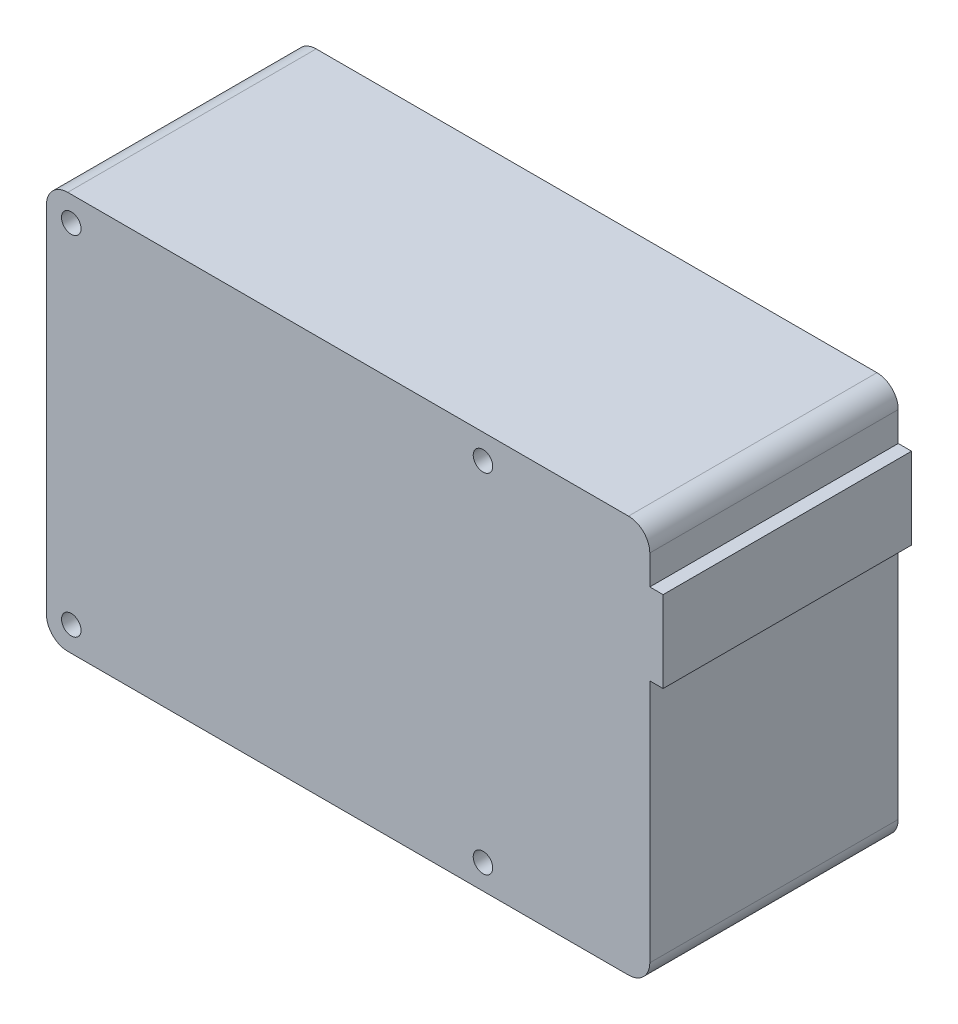
ISO-10303-21;
HEADER;
FILE_DESCRIPTION(('STEP AP214'),'2;1');
FILE_NAME('part.step','',(''),(''),'','','');
FILE_SCHEMA(('AUTOMOTIVE_DESIGN { 1 0 10303 214 1 1 1 1 }'));
ENDSEC;
DATA;
#1=APPLICATION_CONTEXT('core data for automotive mechanical design processes');
#2=APPLICATION_PROTOCOL_DEFINITION('international standard','automotive_design',2000,#1);
#3=PRODUCT_CONTEXT('',#1,'mechanical');
#4=PRODUCT('Part','Part','',(#3));
#5=PRODUCT_RELATED_PRODUCT_CATEGORY('part','',(#4));
#6=PRODUCT_DEFINITION_FORMATION('','',#4);
#7=PRODUCT_DEFINITION_CONTEXT('part definition',#1,'design');
#8=PRODUCT_DEFINITION('design','',#6,#7);
#9=PRODUCT_DEFINITION_SHAPE('','',#8);
#10=(LENGTH_UNIT() NAMED_UNIT(*) SI_UNIT(.MILLI.,.METRE.));
#11=(NAMED_UNIT(*) PLANE_ANGLE_UNIT() SI_UNIT($,.RADIAN.));
#12=(NAMED_UNIT(*) SI_UNIT($,.STERADIAN.) SOLID_ANGLE_UNIT());
#13=UNCERTAINTY_MEASURE_WITH_UNIT(LENGTH_MEASURE(1.E-05),#10,'distance_accuracy_value','');
#14=(GEOMETRIC_REPRESENTATION_CONTEXT(3) GLOBAL_UNCERTAINTY_ASSIGNED_CONTEXT((#13)) GLOBAL_UNIT_ASSIGNED_CONTEXT((#10,
#11,#12)) REPRESENTATION_CONTEXT('',''));
#15=CARTESIAN_POINT('',(0.,0.,0.));
#16=DIRECTION('',(0.,0.,1.));
#17=DIRECTION('',(1.,0.,0.));
#18=AXIS2_PLACEMENT_3D('',#15,#16,#17);
#19=CARTESIAN_POINT('',(42.5,0.,35.));
#20=DIRECTION('',(1.,0.,0.));
#21=DIRECTION('',(0.,1.,0.));
#22=AXIS2_PLACEMENT_3D('',#19,#20,#21);
#23=PLANE('',#22);
#24=DIRECTION('',(0.,-1.,0.));
#25=VECTOR('',#24,1.);
#26=CARTESIAN_POINT('',(42.5,0.,0.));
#27=LINE('',#26,#25);
#28=CARTESIAN_POINT('',(42.5,9.39879059842159,0.));
#29=VERTEX_POINT('',#28);
#30=CARTESIAN_POINT('',(42.5,-25.,0.));
#31=VERTEX_POINT('',#30);
#32=EDGE_CURVE('E163',#29,#31,#27,.T.);
#33=ORIENTED_EDGE('',*,*,#32,.F.);
#34=DIRECTION('',(0.,0.,-1.));
#35=VECTOR('',#34,1.);
#36=CARTESIAN_POINT('',(42.5,9.39879059842159,35.));
#37=LINE('',#36,#35);
#38=CARTESIAN_POINT('',(42.5,9.39879059842159,35.));
#39=VERTEX_POINT('',#38);
#40=EDGE_CURVE('E11',#39,#29,#37,.T.);
#41=ORIENTED_EDGE('',*,*,#40,.F.);
#42=DIRECTION('',(0.,-1.,0.));
#43=VECTOR('',#42,1.);
#44=CARTESIAN_POINT('',(42.5,0.,35.));
#45=LINE('',#44,#43);
#46=CARTESIAN_POINT('',(42.5,-25.,35.));
#47=VERTEX_POINT('',#46);
#48=EDGE_CURVE('E202',#39,#47,#45,.T.);
#49=ORIENTED_EDGE('',*,*,#48,.T.);
#50=DIRECTION('',(0.,0.,-1.));
#51=VECTOR('',#50,1.);
#52=CARTESIAN_POINT('',(42.5,-25.,35.));
#53=LINE('',#52,#51);
#54=EDGE_CURVE('E96',#47,#31,#53,.T.);
#55=ORIENTED_EDGE('',*,*,#54,.T.);
#56=EDGE_LOOP('',(#33,#41,#49,#55));
#57=FACE_BOUND('',#56,.T.);
#58=ADVANCED_FACE('F32',(#57),#23,.T.);
#59=CARTESIAN_POINT('',(0.,9.39879059842159,35.));
#60=DIRECTION('',(0.,1.,0.));
#61=DIRECTION('',(0.,0.,1.));
#62=AXIS2_PLACEMENT_3D('',#59,#60,#61);
#63=PLANE('',#62);
#64=DIRECTION('',(1.,0.,0.));
#65=VECTOR('',#64,1.);
#66=CARTESIAN_POINT('',(0.,9.39879059842159,0.));
#67=LINE('',#66,#65);
#68=CARTESIAN_POINT('',(44.375741610867,9.39879059842159,0.));
#69=VERTEX_POINT('',#68);
#70=EDGE_CURVE('E166',#29,#69,#67,.T.);
#71=ORIENTED_EDGE('',*,*,#70,.T.);
#72=DIRECTION('',(0.,0.,-1.));
#73=VECTOR('',#72,1.);
#74=CARTESIAN_POINT('',(44.375741610867,9.39879059842159,35.));
#75=LINE('',#74,#73);
#76=CARTESIAN_POINT('',(44.375741610867,9.39879059842159,35.));
#77=VERTEX_POINT('',#76);
#78=EDGE_CURVE('E41',#77,#69,#75,.T.);
#79=ORIENTED_EDGE('',*,*,#78,.F.);
#80=DIRECTION('',(1.,0.,0.));
#81=VECTOR('',#80,1.);
#82=CARTESIAN_POINT('',(0.,9.39879059842159,35.));
#83=LINE('',#82,#81);
#84=EDGE_CURVE('E240',#39,#77,#83,.T.);
#85=ORIENTED_EDGE('',*,*,#84,.F.);
#86=ORIENTED_EDGE('',*,*,#40,.T.);
#87=EDGE_LOOP('',(#71,#79,#85,#86));
#88=FACE_BOUND('',#87,.T.);
#89=ADVANCED_FACE('F34',(#88),#63,.F.);
#90=CARTESIAN_POINT('',(44.375741610867,0.,35.));
#91=DIRECTION('',(1.,0.,0.));
#92=DIRECTION('',(0.,0.,-1.));
#93=AXIS2_PLACEMENT_3D('',#90,#91,#92);
#94=PLANE('',#93);
#95=DIRECTION('',(0.,-1.,0.));
#96=VECTOR('',#95,1.);
#97=CARTESIAN_POINT('',(44.375741610867,0.,0.));
#98=LINE('',#97,#96);
#99=CARTESIAN_POINT('',(44.375741610867,20.8580114794774,0.));
#100=VERTEX_POINT('',#99);
#101=EDGE_CURVE('E170',#100,#69,#98,.T.);
#102=ORIENTED_EDGE('',*,*,#101,.F.);
#103=DIRECTION('',(0.,0.,-1.));
#104=VECTOR('',#103,1.);
#105=CARTESIAN_POINT('',(44.375741610867,20.8580114794774,35.));
#106=LINE('',#105,#104);
#107=CARTESIAN_POINT('',(44.375741610867,20.8580114794774,35.));
#108=VERTEX_POINT('',#107);
#109=EDGE_CURVE('E217',#108,#100,#106,.T.);
#110=ORIENTED_EDGE('',*,*,#109,.F.);
#111=DIRECTION('',(0.,-1.,0.));
#112=VECTOR('',#111,1.);
#113=CARTESIAN_POINT('',(44.375741610867,0.,35.));
#114=LINE('',#113,#112);
#115=EDGE_CURVE('E224',#108,#77,#114,.T.);
#116=ORIENTED_EDGE('',*,*,#115,.T.);
#117=ORIENTED_EDGE('',*,*,#78,.T.);
#118=EDGE_LOOP('',(#102,#110,#116,#117));
#119=FACE_BOUND('',#118,.T.);
#120=ADVANCED_FACE('F222',(#119),#94,.T.);
#121=CARTESIAN_POINT('',(0.,20.8580114794774,35.));
#122=DIRECTION('',(0.,1.,0.));
#123=DIRECTION('',(0.,0.,1.));
#124=AXIS2_PLACEMENT_3D('',#121,#122,#123);
#125=PLANE('',#124);
#126=DIRECTION('',(1.,0.,0.));
#127=VECTOR('',#126,1.);
#128=CARTESIAN_POINT('',(0.,20.8580114794774,0.));
#129=LINE('',#128,#127);
#130=CARTESIAN_POINT('',(42.5,20.8580114794774,0.));
#131=VERTEX_POINT('',#130);
#132=EDGE_CURVE('E173',#131,#100,#129,.T.);
#133=ORIENTED_EDGE('',*,*,#132,.F.);
#134=DIRECTION('',(0.,0.,-1.));
#135=VECTOR('',#134,1.);
#136=CARTESIAN_POINT('',(42.5,20.8580114794774,35.));
#137=LINE('',#136,#135);
#138=CARTESIAN_POINT('',(42.5,20.8580114794774,35.));
#139=VERTEX_POINT('',#138);
#140=EDGE_CURVE('E215',#139,#131,#137,.T.);
#141=ORIENTED_EDGE('',*,*,#140,.F.);
#142=DIRECTION('',(1.,0.,0.));
#143=VECTOR('',#142,1.);
#144=CARTESIAN_POINT('',(0.,20.8580114794774,35.));
#145=LINE('',#144,#143);
#146=EDGE_CURVE('E237',#139,#108,#145,.T.);
#147=ORIENTED_EDGE('',*,*,#146,.T.);
#148=ORIENTED_EDGE('',*,*,#109,.T.);
#149=EDGE_LOOP('',(#133,#141,#147,#148));
#150=FACE_BOUND('',#149,.T.);
#151=ADVANCED_FACE('F234',(#150),#125,.T.);
#152=CARTESIAN_POINT('',(42.5,25.,0.));
#153=VERTEX_POINT('',#152);
#154=EDGE_CURVE('E167',#153,#131,#27,.T.);
#155=ORIENTED_EDGE('',*,*,#154,.F.);
#156=DIRECTION('',(0.,0.,-1.));
#157=VECTOR('',#156,1.);
#158=CARTESIAN_POINT('',(42.5,25.,35.));
#159=LINE('',#158,#157);
#160=CARTESIAN_POINT('',(42.5,25.,35.));
#161=VERTEX_POINT('',#160);
#162=EDGE_CURVE('E213',#161,#153,#159,.T.);
#163=ORIENTED_EDGE('',*,*,#162,.F.);
#164=EDGE_CURVE('E242',#161,#139,#45,.T.);
#165=ORIENTED_EDGE('',*,*,#164,.T.);
#166=ORIENTED_EDGE('',*,*,#140,.T.);
#167=EDGE_LOOP('',(#155,#163,#165,#166));
#168=FACE_BOUND('',#167,.T.);
#169=ADVANCED_FACE('F268',(#168),#23,.T.);
#170=CARTESIAN_POINT('',(39.5,25.,35.));
#171=DIRECTION('',(0.,0.,-1.));
#172=DIRECTION('',(-1.,0.,0.));
#173=AXIS2_PLACEMENT_3D('',#170,#171,#172);
#174=CYLINDRICAL_SURFACE('',#173,3.);
#175=CARTESIAN_POINT('',(39.5,25.,0.));
#176=DIRECTION('',(0.,0.,1.));
#177=DIRECTION('',(1.,0.,0.));
#178=AXIS2_PLACEMENT_3D('',#175,#176,#177);
#179=CIRCLE('',#178,3.);
#180=CARTESIAN_POINT('',(39.5,28.,0.));
#181=VERTEX_POINT('',#180);
#182=EDGE_CURVE('E176',#181,#153,#179,.F.);
#183=ORIENTED_EDGE('',*,*,#182,.F.);
#184=DIRECTION('',(0.,0.,-1.));
#185=VECTOR('',#184,1.);
#186=CARTESIAN_POINT('',(39.5,28.,35.));
#187=LINE('',#186,#185);
#188=CARTESIAN_POINT('',(39.5,28.,35.));
#189=VERTEX_POINT('',#188);
#190=EDGE_CURVE('E211',#189,#181,#187,.T.);
#191=ORIENTED_EDGE('',*,*,#190,.F.);
#192=CARTESIAN_POINT('',(39.5,25.,35.));
#193=DIRECTION('',(0.,0.,1.));
#194=DIRECTION('',(1.,0.,0.));
#195=AXIS2_PLACEMENT_3D('',#192,#193,#194);
#196=CIRCLE('',#195,3.);
#197=EDGE_CURVE('E247',#189,#161,#196,.F.);
#198=ORIENTED_EDGE('',*,*,#197,.T.);
#199=ORIENTED_EDGE('',*,*,#162,.T.);
#200=EDGE_LOOP('',(#183,#191,#198,#199));
#201=FACE_BOUND('',#200,.T.);
#202=ADVANCED_FACE('F271',(#201),#174,.T.);
#203=CARTESIAN_POINT('',(0.,28.,35.));
#204=DIRECTION('',(0.,1.,0.));
#205=DIRECTION('',(0.,0.,1.));
#206=AXIS2_PLACEMENT_3D('',#203,#204,#205);
#207=PLANE('',#206);
#208=DIRECTION('',(1.,0.,0.));
#209=VECTOR('',#208,1.);
#210=CARTESIAN_POINT('',(0.,28.,0.));
#211=LINE('',#210,#209);
#212=CARTESIAN_POINT('',(-39.5,28.,0.));
#213=VERTEX_POINT('',#212);
#214=EDGE_CURVE('E179',#213,#181,#211,.T.);
#215=ORIENTED_EDGE('',*,*,#214,.F.);
#216=DIRECTION('',(0.,0.,-1.));
#217=VECTOR('',#216,1.);
#218=CARTESIAN_POINT('',(-39.5,28.,35.));
#219=LINE('',#218,#217);
#220=CARTESIAN_POINT('',(-39.5,28.,35.));
#221=VERTEX_POINT('',#220);
#222=EDGE_CURVE('E209',#221,#213,#219,.T.);
#223=ORIENTED_EDGE('',*,*,#222,.F.);
#224=DIRECTION('',(1.,0.,0.));
#225=VECTOR('',#224,1.);
#226=CARTESIAN_POINT('',(0.,28.,35.));
#227=LINE('',#226,#225);
#228=EDGE_CURVE('E250',#221,#189,#227,.T.);
#229=ORIENTED_EDGE('',*,*,#228,.T.);
#230=ORIENTED_EDGE('',*,*,#190,.T.);
#231=EDGE_LOOP('',(#215,#223,#229,#230));
#232=FACE_BOUND('',#231,.T.);
#233=ADVANCED_FACE('F274',(#232),#207,.T.);
#234=CARTESIAN_POINT('',(-39.5,25.,35.));
#235=DIRECTION('',(0.,0.,-1.));
#236=DIRECTION('',(-1.,0.,0.));
#237=AXIS2_PLACEMENT_3D('',#234,#235,#236);
#238=CYLINDRICAL_SURFACE('',#237,3.);
#239=CARTESIAN_POINT('',(-39.5,25.,0.));
#240=DIRECTION('',(0.,0.,1.));
#241=DIRECTION('',(1.,0.,0.));
#242=AXIS2_PLACEMENT_3D('',#239,#240,#241);
#243=CIRCLE('',#242,3.);
#244=CARTESIAN_POINT('',(-42.5,25.,0.));
#245=VERTEX_POINT('',#244);
#246=EDGE_CURVE('E182',#213,#245,#243,.T.);
#247=ORIENTED_EDGE('',*,*,#246,.T.);
#248=DIRECTION('',(0.,0.,-1.));
#249=VECTOR('',#248,1.);
#250=CARTESIAN_POINT('',(-42.5,25.,35.));
#251=LINE('',#250,#249);
#252=CARTESIAN_POINT('',(-42.5,25.,35.));
#253=VERTEX_POINT('',#252);
#254=EDGE_CURVE('E206',#253,#245,#251,.T.);
#255=ORIENTED_EDGE('',*,*,#254,.F.);
#256=CARTESIAN_POINT('',(-39.5,25.,35.));
#257=DIRECTION('',(0.,0.,1.));
#258=DIRECTION('',(1.,0.,0.));
#259=AXIS2_PLACEMENT_3D('',#256,#257,#258);
#260=CIRCLE('',#259,3.);
#261=EDGE_CURVE('E253',#221,#253,#260,.T.);
#262=ORIENTED_EDGE('',*,*,#261,.F.);
#263=ORIENTED_EDGE('',*,*,#222,.T.);
#264=EDGE_LOOP('',(#247,#255,#262,#263));
#265=FACE_BOUND('',#264,.T.);
#266=ADVANCED_FACE('F259',(#265),#238,.T.);
#267=CARTESIAN_POINT('',(-42.5,0.,35.));
#268=DIRECTION('',(1.,0.,0.));
#269=DIRECTION('',(0.,1.,0.));
#270=AXIS2_PLACEMENT_3D('',#267,#268,#269);
#271=PLANE('',#270);
#272=DIRECTION('',(0.,-1.,0.));
#273=VECTOR('',#272,1.);
#274=CARTESIAN_POINT('',(-42.5,0.,0.));
#275=LINE('',#274,#273);
#276=CARTESIAN_POINT('',(-42.5,-25.,0.));
#277=VERTEX_POINT('',#276);
#278=EDGE_CURVE('E184',#245,#277,#275,.T.);
#279=ORIENTED_EDGE('',*,*,#278,.T.);
#280=DIRECTION('',(0.,0.,-1.));
#281=VECTOR('',#280,1.);
#282=CARTESIAN_POINT('',(-42.5,-25.,35.));
#283=LINE('',#282,#281);
#284=CARTESIAN_POINT('',(-42.5,-25.,35.));
#285=VERTEX_POINT('',#284);
#286=EDGE_CURVE('E143',#285,#277,#283,.T.);
#287=ORIENTED_EDGE('',*,*,#286,.F.);
#288=DIRECTION('',(0.,-1.,0.));
#289=VECTOR('',#288,1.);
#290=CARTESIAN_POINT('',(-42.5,0.,35.));
#291=LINE('',#290,#289);
#292=EDGE_CURVE('E134',#253,#285,#291,.T.);
#293=ORIENTED_EDGE('',*,*,#292,.F.);
#294=ORIENTED_EDGE('',*,*,#254,.T.);
#295=EDGE_LOOP('',(#279,#287,#293,#294));
#296=FACE_BOUND('',#295,.T.);
#297=ADVANCED_FACE('F263',(#296),#271,.F.);
#298=CARTESIAN_POINT('',(-39.5,-25.,35.));
#299=DIRECTION('',(0.,0.,-1.));
#300=DIRECTION('',(-1.,0.,0.));
#301=AXIS2_PLACEMENT_3D('',#298,#299,#300);
#302=CYLINDRICAL_SURFACE('',#301,3.);
#303=CARTESIAN_POINT('',(-39.5,-25.,0.));
#304=DIRECTION('',(0.,0.,1.));
#305=DIRECTION('',(1.,0.,0.));
#306=AXIS2_PLACEMENT_3D('',#303,#304,#305);
#307=CIRCLE('',#306,3.);
#308=CARTESIAN_POINT('',(-39.5,-28.,0.));
#309=VERTEX_POINT('',#308);
#310=EDGE_CURVE('E142',#277,#309,#307,.T.);
#311=ORIENTED_EDGE('',*,*,#310,.T.);
#312=DIRECTION('',(0.,0.,-1.));
#313=VECTOR('',#312,1.);
#314=CARTESIAN_POINT('',(-39.5,-28.,35.));
#315=LINE('',#314,#313);
#316=CARTESIAN_POINT('',(-39.5,-28.,35.));
#317=VERTEX_POINT('',#316);
#318=EDGE_CURVE('E139',#317,#309,#315,.T.);
#319=ORIENTED_EDGE('',*,*,#318,.F.);
#320=CARTESIAN_POINT('',(-39.5,-25.,35.));
#321=DIRECTION('',(0.,0.,1.));
#322=DIRECTION('',(1.,0.,0.));
#323=AXIS2_PLACEMENT_3D('',#320,#321,#322);
#324=CIRCLE('',#323,3.);
#325=EDGE_CURVE('E127',#285,#317,#324,.T.);
#326=ORIENTED_EDGE('',*,*,#325,.F.);
#327=ORIENTED_EDGE('',*,*,#286,.T.);
#328=EDGE_LOOP('',(#311,#319,#326,#327));
#329=FACE_BOUND('',#328,.T.);
#330=ADVANCED_FACE('F140',(#329),#302,.T.);
#331=CARTESIAN_POINT('',(0.,-28.,35.));
#332=DIRECTION('',(0.,1.,0.));
#333=DIRECTION('',(0.,0.,1.));
#334=AXIS2_PLACEMENT_3D('',#331,#332,#333);
#335=PLANE('',#334);
#336=DIRECTION('',(1.,0.,0.));
#337=VECTOR('',#336,1.);
#338=CARTESIAN_POINT('',(0.,-28.,0.));
#339=LINE('',#338,#337);
#340=CARTESIAN_POINT('',(39.5,-28.,0.));
#341=VERTEX_POINT('',#340);
#342=EDGE_CURVE('E89',#309,#341,#339,.T.);
#343=ORIENTED_EDGE('',*,*,#342,.T.);
#344=DIRECTION('',(0.,0.,-1.));
#345=VECTOR('',#344,1.);
#346=CARTESIAN_POINT('',(39.5,-28.,35.));
#347=LINE('',#346,#345);
#348=CARTESIAN_POINT('',(39.5,-28.,35.));
#349=VERTEX_POINT('',#348);
#350=EDGE_CURVE('E144',#349,#341,#347,.T.);
#351=ORIENTED_EDGE('',*,*,#350,.F.);
#352=DIRECTION('',(1.,0.,0.));
#353=VECTOR('',#352,1.);
#354=CARTESIAN_POINT('',(0.,-28.,35.));
#355=LINE('',#354,#353);
#356=EDGE_CURVE('E132',#317,#349,#355,.T.);
#357=ORIENTED_EDGE('',*,*,#356,.F.);
#358=ORIENTED_EDGE('',*,*,#318,.T.);
#359=EDGE_LOOP('',(#343,#351,#357,#358));
#360=FACE_BOUND('',#359,.T.);
#361=ADVANCED_FACE('F146',(#360),#335,.F.);
#362=CARTESIAN_POINT('',(-39.,24.5,35.));
#363=DIRECTION('',(0.,0.,-1.));
#364=DIRECTION('',(-1.,0.,0.));
#365=AXIS2_PLACEMENT_3D('',#362,#363,#364);
#366=CYLINDRICAL_SURFACE('',#365,1.375);
#367=CARTESIAN_POINT('',(-39.,24.5,35.));
#368=DIRECTION('',(0.,0.,1.));
#369=DIRECTION('',(1.,0.,0.));
#370=AXIS2_PLACEMENT_3D('',#367,#368,#369);
#371=CIRCLE('',#370,1.375);
#372=CARTESIAN_POINT('',(-37.625,24.5,35.));
#373=VERTEX_POINT('',#372);
#374=EDGE_CURVE('E157',#373,#373,#371,.T.);
#375=ORIENTED_EDGE('',*,*,#374,.T.);
#376=EDGE_LOOP('',(#375));
#377=FACE_BOUND('',#376,.T.);
#378=CARTESIAN_POINT('',(-39.,24.5,0.));
#379=DIRECTION('',(0.,0.,1.));
#380=DIRECTION('',(1.,0.,0.));
#381=AXIS2_PLACEMENT_3D('',#378,#379,#380);
#382=CIRCLE('',#381,1.375);
#383=CARTESIAN_POINT('',(-37.625,24.5,0.));
#384=VERTEX_POINT('',#383);
#385=EDGE_CURVE('E196',#384,#384,#382,.T.);
#386=ORIENTED_EDGE('',*,*,#385,.F.);
#387=EDGE_LOOP('',(#386));
#388=FACE_BOUND('',#387,.T.);
#389=ADVANCED_FACE('F354',(#377,#388),#366,.F.);
#390=CARTESIAN_POINT('',(19.,24.5,35.));
#391=DIRECTION('',(0.,0.,-1.));
#392=DIRECTION('',(-1.,0.,0.));
#393=AXIS2_PLACEMENT_3D('',#390,#391,#392);
#394=CYLINDRICAL_SURFACE('',#393,1.375);
#395=CARTESIAN_POINT('',(19.,24.5,35.));
#396=DIRECTION('',(0.,0.,1.));
#397=DIRECTION('',(1.,0.,0.));
#398=AXIS2_PLACEMENT_3D('',#395,#396,#397);
#399=CIRCLE('',#398,1.375);
#400=CARTESIAN_POINT('',(20.375,24.5,35.));
#401=VERTEX_POINT('',#400);
#402=EDGE_CURVE('E154',#401,#401,#399,.T.);
#403=ORIENTED_EDGE('',*,*,#402,.T.);
#404=EDGE_LOOP('',(#403));
#405=FACE_BOUND('',#404,.T.);
#406=CARTESIAN_POINT('',(19.,24.5,0.));
#407=DIRECTION('',(0.,0.,1.));
#408=DIRECTION('',(1.,0.,0.));
#409=AXIS2_PLACEMENT_3D('',#406,#407,#408);
#410=CIRCLE('',#409,1.375);
#411=CARTESIAN_POINT('',(20.375,24.5,0.));
#412=VERTEX_POINT('',#411);
#413=EDGE_CURVE('E193',#412,#412,#410,.T.);
#414=ORIENTED_EDGE('',*,*,#413,.F.);
#415=EDGE_LOOP('',(#414));
#416=FACE_BOUND('',#415,.T.);
#417=ADVANCED_FACE('F362',(#405,#416),#394,.F.);
#418=CARTESIAN_POINT('',(19.,-24.5,35.));
#419=DIRECTION('',(0.,0.,-1.));
#420=DIRECTION('',(-1.,0.,0.));
#421=AXIS2_PLACEMENT_3D('',#418,#419,#420);
#422=CYLINDRICAL_SURFACE('',#421,1.375);
#423=CARTESIAN_POINT('',(19.,-24.5,35.));
#424=DIRECTION('',(0.,0.,1.));
#425=DIRECTION('',(1.,0.,0.));
#426=AXIS2_PLACEMENT_3D('',#423,#424,#425);
#427=CIRCLE('',#426,1.375);
#428=CARTESIAN_POINT('',(20.375,-24.5,35.));
#429=VERTEX_POINT('',#428);
#430=EDGE_CURVE('E148',#429,#429,#427,.T.);
#431=ORIENTED_EDGE('',*,*,#430,.T.);
#432=EDGE_LOOP('',(#431));
#433=FACE_BOUND('',#432,.T.);
#434=CARTESIAN_POINT('',(19.,-24.5,0.));
#435=DIRECTION('',(0.,0.,1.));
#436=DIRECTION('',(1.,0.,0.));
#437=AXIS2_PLACEMENT_3D('',#434,#435,#436);
#438=CIRCLE('',#437,1.375);
#439=CARTESIAN_POINT('',(20.375,-24.5,0.));
#440=VERTEX_POINT('',#439);
#441=EDGE_CURVE('E190',#440,#440,#438,.T.);
#442=ORIENTED_EDGE('',*,*,#441,.F.);
#443=EDGE_LOOP('',(#442));
#444=FACE_BOUND('',#443,.T.);
#445=ADVANCED_FACE('F371',(#433,#444),#422,.F.);
#446=CARTESIAN_POINT('',(39.5,-25.,35.));
#447=DIRECTION('',(0.,0.,-1.));
#448=DIRECTION('',(-1.,0.,0.));
#449=AXIS2_PLACEMENT_3D('',#446,#447,#448);
#450=CYLINDRICAL_SURFACE('',#449,3.);
#451=CARTESIAN_POINT('',(39.5,-25.,0.));
#452=DIRECTION('',(0.,0.,1.));
#453=DIRECTION('',(1.,0.,0.));
#454=AXIS2_PLACEMENT_3D('',#451,#452,#453);
#455=CIRCLE('',#454,3.);
#456=EDGE_CURVE('E188',#341,#31,#455,.T.);
#457=ORIENTED_EDGE('',*,*,#456,.T.);
#458=ORIENTED_EDGE('',*,*,#54,.F.);
#459=CARTESIAN_POINT('',(39.5,-25.,35.));
#460=DIRECTION('',(0.,0.,1.));
#461=DIRECTION('',(1.,0.,0.));
#462=AXIS2_PLACEMENT_3D('',#459,#460,#461);
#463=CIRCLE('',#462,3.);
#464=EDGE_CURVE('E49',#349,#47,#463,.T.);
#465=ORIENTED_EDGE('',*,*,#464,.F.);
#466=ORIENTED_EDGE('',*,*,#350,.T.);
#467=EDGE_LOOP('',(#457,#458,#465,#466));
#468=FACE_BOUND('',#467,.T.);
#469=ADVANCED_FACE('F266',(#468),#450,.T.);
#470=CARTESIAN_POINT('',(-39.,-24.5,35.));
#471=DIRECTION('',(0.,0.,-1.));
#472=DIRECTION('',(-1.,0.,0.));
#473=AXIS2_PLACEMENT_3D('',#470,#471,#472);
#474=CYLINDRICAL_SURFACE('',#473,1.375);
#475=CARTESIAN_POINT('',(-39.,-24.5,35.));
#476=DIRECTION('',(0.,0.,1.));
#477=DIRECTION('',(1.,0.,0.));
#478=AXIS2_PLACEMENT_3D('',#475,#476,#477);
#479=CIRCLE('',#478,1.375);
#480=CARTESIAN_POINT('',(-37.625,-24.5,35.));
#481=VERTEX_POINT('',#480);
#482=EDGE_CURVE('E160',#481,#481,#479,.T.);
#483=ORIENTED_EDGE('',*,*,#482,.T.);
#484=EDGE_LOOP('',(#483));
#485=FACE_BOUND('',#484,.T.);
#486=CARTESIAN_POINT('',(-39.,-24.5,0.));
#487=DIRECTION('',(0.,0.,1.));
#488=DIRECTION('',(1.,0.,0.));
#489=AXIS2_PLACEMENT_3D('',#486,#487,#488);
#490=CIRCLE('',#489,1.375);
#491=CARTESIAN_POINT('',(-37.625,-24.5,0.));
#492=VERTEX_POINT('',#491);
#493=EDGE_CURVE('E199',#492,#492,#490,.T.);
#494=ORIENTED_EDGE('',*,*,#493,.F.);
#495=EDGE_LOOP('',(#494));
#496=FACE_BOUND('',#495,.T.);
#497=ADVANCED_FACE('F388',(#485,#496),#474,.F.);
#498=CARTESIAN_POINT('',(0.,0.,35.));
#499=DIRECTION('',(0.,0.,1.));
#500=DIRECTION('',(1.,0.,0.));
#501=AXIS2_PLACEMENT_3D('',#498,#499,#500);
#502=PLANE('',#501);
#503=ORIENTED_EDGE('',*,*,#48,.F.);
#504=ORIENTED_EDGE('',*,*,#84,.T.);
#505=ORIENTED_EDGE('',*,*,#115,.F.);
#506=ORIENTED_EDGE('',*,*,#146,.F.);
#507=ORIENTED_EDGE('',*,*,#164,.F.);
#508=ORIENTED_EDGE('',*,*,#197,.F.);
#509=ORIENTED_EDGE('',*,*,#228,.F.);
#510=ORIENTED_EDGE('',*,*,#261,.T.);
#511=ORIENTED_EDGE('',*,*,#292,.T.);
#512=ORIENTED_EDGE('',*,*,#325,.T.);
#513=ORIENTED_EDGE('',*,*,#356,.T.);
#514=ORIENTED_EDGE('',*,*,#464,.T.);
#515=EDGE_LOOP('',(#503,#504,#505,#506,#507,#508,#509,#510,#511,#512,#513,#514));
#516=FACE_BOUND('',#515,.T.);
#517=ORIENTED_EDGE('',*,*,#430,.F.);
#518=EDGE_LOOP('',(#517));
#519=FACE_BOUND('',#518,.T.);
#520=ORIENTED_EDGE('',*,*,#402,.F.);
#521=EDGE_LOOP('',(#520));
#522=FACE_BOUND('',#521,.T.);
#523=ORIENTED_EDGE('',*,*,#374,.F.);
#524=EDGE_LOOP('',(#523));
#525=FACE_BOUND('',#524,.T.);
#526=ORIENTED_EDGE('',*,*,#482,.F.);
#527=EDGE_LOOP('',(#526));
#528=FACE_BOUND('',#527,.T.);
#529=ADVANCED_FACE('F129',(#516,#519,#522,#525,#528),#502,.T.);
#530=CARTESIAN_POINT('',(0.,0.,0.));
#531=DIRECTION('',(0.,0.,1.));
#532=DIRECTION('',(1.,0.,0.));
#533=AXIS2_PLACEMENT_3D('',#530,#531,#532);
#534=PLANE('',#533);
#535=ORIENTED_EDGE('',*,*,#32,.T.);
#536=ORIENTED_EDGE('',*,*,#456,.F.);
#537=ORIENTED_EDGE('',*,*,#342,.F.);
#538=ORIENTED_EDGE('',*,*,#310,.F.);
#539=ORIENTED_EDGE('',*,*,#278,.F.);
#540=ORIENTED_EDGE('',*,*,#246,.F.);
#541=ORIENTED_EDGE('',*,*,#214,.T.);
#542=ORIENTED_EDGE('',*,*,#182,.T.);
#543=ORIENTED_EDGE('',*,*,#154,.T.);
#544=ORIENTED_EDGE('',*,*,#132,.T.);
#545=ORIENTED_EDGE('',*,*,#101,.T.);
#546=ORIENTED_EDGE('',*,*,#70,.F.);
#547=EDGE_LOOP('',(#535,#536,#537,#538,#539,#540,#541,#542,#543,#544,#545,#546));
#548=FACE_BOUND('',#547,.T.);
#549=ORIENTED_EDGE('',*,*,#441,.T.);
#550=EDGE_LOOP('',(#549));
#551=FACE_BOUND('',#550,.T.);
#552=ORIENTED_EDGE('',*,*,#413,.T.);
#553=EDGE_LOOP('',(#552));
#554=FACE_BOUND('',#553,.T.);
#555=ORIENTED_EDGE('',*,*,#385,.T.);
#556=EDGE_LOOP('',(#555));
#557=FACE_BOUND('',#556,.T.);
#558=ORIENTED_EDGE('',*,*,#493,.T.);
#559=EDGE_LOOP('',(#558));
#560=FACE_BOUND('',#559,.T.);
#561=ADVANCED_FACE('F228',(#548,#551,#554,#557,#560),#534,.F.);
#562=CLOSED_SHELL('',(#58,#89,#120,#151,#169,#202,#233,#266,#297,#330,#361,#389,#417,#445,#469,
#497,#529,#561));
#563=MANIFOLD_SOLID_BREP('B2',#562);
#564=ADVANCED_BREP_SHAPE_REPRESENTATION('',(#18,#563),#14);
#565=SHAPE_DEFINITION_REPRESENTATION(#9,#564);
ENDSEC;
END-ISO-10303-21;
